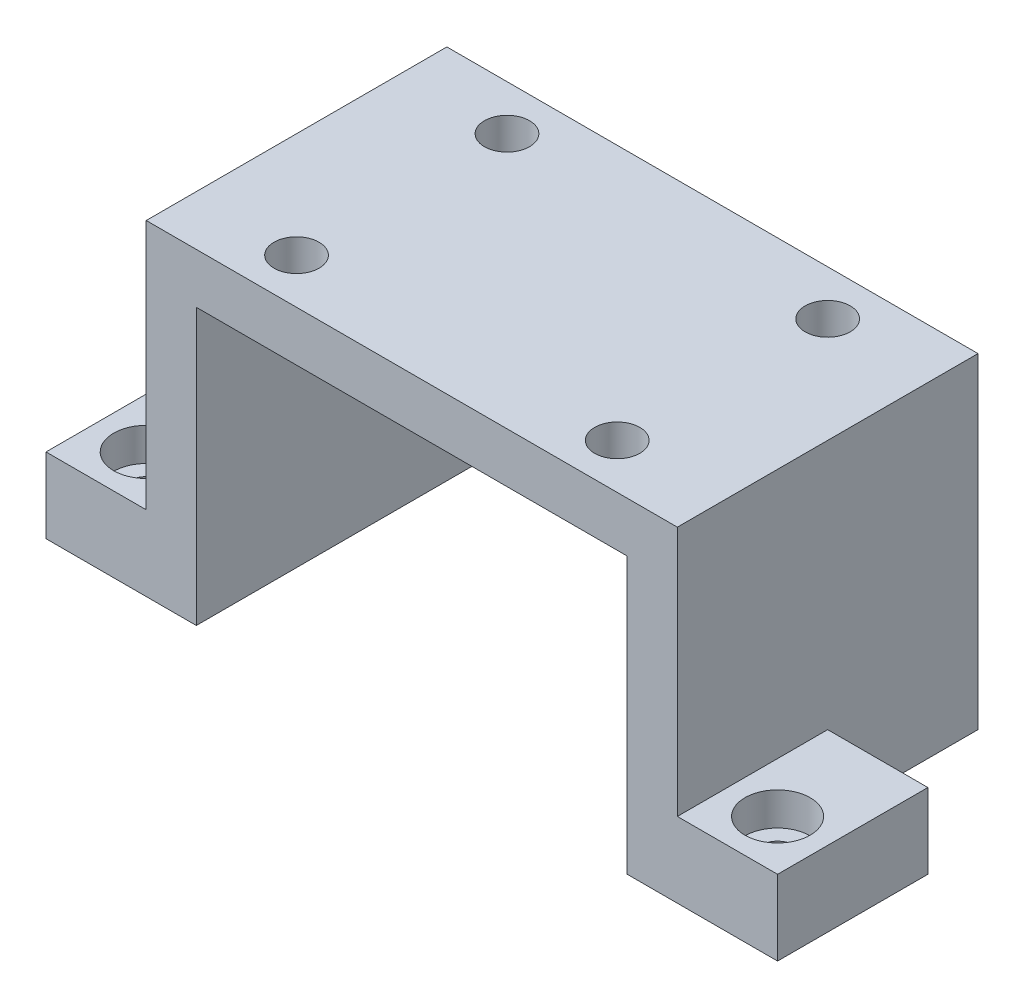
ISO-10303-21;
HEADER;
FILE_DESCRIPTION(('STEP AP214'),'2;1');
FILE_NAME('part.step','',(''),(''),'','','');
FILE_SCHEMA(('AUTOMOTIVE_DESIGN { 1 0 10303 214 1 1 1 1 }'));
ENDSEC;
DATA;
#1=APPLICATION_CONTEXT('core data for automotive mechanical design processes');
#2=APPLICATION_PROTOCOL_DEFINITION('international standard','automotive_design',2000,#1);
#3=PRODUCT_CONTEXT('',#1,'mechanical');
#4=PRODUCT('Part','Part','',(#3));
#5=PRODUCT_RELATED_PRODUCT_CATEGORY('part','',(#4));
#6=PRODUCT_DEFINITION_FORMATION('','',#4);
#7=PRODUCT_DEFINITION_CONTEXT('part definition',#1,'design');
#8=PRODUCT_DEFINITION('design','',#6,#7);
#9=PRODUCT_DEFINITION_SHAPE('','',#8);
#10=(LENGTH_UNIT() NAMED_UNIT(*) SI_UNIT(.MILLI.,.METRE.));
#11=(NAMED_UNIT(*) PLANE_ANGLE_UNIT() SI_UNIT($,.RADIAN.));
#12=(NAMED_UNIT(*) SI_UNIT($,.STERADIAN.) SOLID_ANGLE_UNIT());
#13=UNCERTAINTY_MEASURE_WITH_UNIT(LENGTH_MEASURE(1.E-05),#10,'distance_accuracy_value','');
#14=(GEOMETRIC_REPRESENTATION_CONTEXT(3) GLOBAL_UNCERTAINTY_ASSIGNED_CONTEXT((#13)) GLOBAL_UNIT_ASSIGNED_CONTEXT((#10,
#11,#12)) REPRESENTATION_CONTEXT('',''));
#15=CARTESIAN_POINT('',(0.,0.,0.));
#16=DIRECTION('',(0.,0.,1.));
#17=DIRECTION('',(1.,0.,0.));
#18=AXIS2_PLACEMENT_3D('',#15,#16,#17);
#19=CARTESIAN_POINT('',(-53.,10.,30.));
#20=DIRECTION('',(1.,0.,0.));
#21=DIRECTION('',(0.,0.,-1.));
#22=AXIS2_PLACEMENT_3D('',#19,#20,#21);
#23=PLANE('',#22);
#24=DIRECTION('',(0.,0.,-1.));
#25=VECTOR('',#24,1.);
#26=CARTESIAN_POINT('',(-53.,-40.,-30.));
#27=LINE('',#26,#25);
#28=CARTESIAN_POINT('',(-53.,-40.,30.));
#29=VERTEX_POINT('',#28);
#30=CARTESIAN_POINT('',(-53.,-40.,-30.));
#31=VERTEX_POINT('',#30);
#32=EDGE_CURVE('E49',#29,#31,#27,.T.);
#33=ORIENTED_EDGE('',*,*,#32,.F.);
#34=DIRECTION('',(0.,-1.,0.));
#35=VECTOR('',#34,1.);
#36=CARTESIAN_POINT('',(-53.,10.,30.));
#37=LINE('',#36,#35);
#38=CARTESIAN_POINT('',(-53.,10.,30.));
#39=VERTEX_POINT('',#38);
#40=EDGE_CURVE('E231',#39,#29,#37,.T.);
#41=ORIENTED_EDGE('',*,*,#40,.F.);
#42=DIRECTION('',(0.,0.,1.));
#43=VECTOR('',#42,1.);
#44=CARTESIAN_POINT('',(-53.,10.,30.));
#45=LINE('',#44,#43);
#46=CARTESIAN_POINT('',(-53.,10.,-30.));
#47=VERTEX_POINT('',#46);
#48=EDGE_CURVE('E222',#47,#39,#45,.T.);
#49=ORIENTED_EDGE('',*,*,#48,.F.);
#50=DIRECTION('',(0.,-1.,0.));
#51=VECTOR('',#50,1.);
#52=CARTESIAN_POINT('',(-53.,10.,-30.));
#53=LINE('',#52,#51);
#54=EDGE_CURVE('E42',#47,#31,#53,.T.);
#55=ORIENTED_EDGE('',*,*,#54,.T.);
#56=EDGE_LOOP('',(#33,#41,#49,#55));
#57=FACE_BOUND('',#56,.T.);
#58=ADVANCED_FACE('F34',(#57),#23,.F.);
#59=CARTESIAN_POINT('',(53.,10.,30.));
#60=DIRECTION('',(-1.,0.,0.));
#61=DIRECTION('',(0.,0.,1.));
#62=AXIS2_PLACEMENT_3D('',#59,#60,#61);
#63=PLANE('',#62);
#64=DIRECTION('',(0.,0.,1.));
#65=VECTOR('',#64,1.);
#66=CARTESIAN_POINT('',(53.,-40.,30.));
#67=LINE('',#66,#65);
#68=CARTESIAN_POINT('',(53.,-40.,0.));
#69=VERTEX_POINT('',#68);
#70=CARTESIAN_POINT('',(53.,-40.,30.));
#71=VERTEX_POINT('',#70);
#72=EDGE_CURVE('E173',#69,#71,#67,.T.);
#73=ORIENTED_EDGE('',*,*,#72,.F.);
#74=DIRECTION('',(0.,1.,0.));
#75=VECTOR('',#74,1.);
#76=CARTESIAN_POINT('',(53.,-40.,0.));
#77=LINE('',#76,#75);
#78=CARTESIAN_POINT('',(53.,-55.,0.));
#79=VERTEX_POINT('',#78);
#80=EDGE_CURVE('E57',#79,#69,#77,.T.);
#81=ORIENTED_EDGE('',*,*,#80,.F.);
#82=DIRECTION('',(0.,0.,1.));
#83=VECTOR('',#82,1.);
#84=CARTESIAN_POINT('',(53.,-55.,30.));
#85=LINE('',#84,#83);
#86=CARTESIAN_POINT('',(53.,-55.,-30.));
#87=VERTEX_POINT('',#86);
#88=EDGE_CURVE('E192',#87,#79,#85,.T.);
#89=ORIENTED_EDGE('',*,*,#88,.F.);
#90=DIRECTION('',(0.,-1.,0.));
#91=VECTOR('',#90,1.);
#92=CARTESIAN_POINT('',(53.,10.,-30.));
#93=LINE('',#92,#91);
#94=CARTESIAN_POINT('',(53.,10.,-30.));
#95=VERTEX_POINT('',#94);
#96=EDGE_CURVE('E11',#95,#87,#93,.T.);
#97=ORIENTED_EDGE('',*,*,#96,.F.);
#98=DIRECTION('',(0.,0.,-1.));
#99=VECTOR('',#98,1.);
#100=CARTESIAN_POINT('',(53.,10.,30.));
#101=LINE('',#100,#99);
#102=CARTESIAN_POINT('',(53.,10.,30.));
#103=VERTEX_POINT('',#102);
#104=EDGE_CURVE('E216',#103,#95,#101,.T.);
#105=ORIENTED_EDGE('',*,*,#104,.F.);
#106=DIRECTION('',(0.,-1.,0.));
#107=VECTOR('',#106,1.);
#108=CARTESIAN_POINT('',(53.,10.,30.));
#109=LINE('',#108,#107);
#110=EDGE_CURVE('E226',#103,#71,#109,.T.);
#111=ORIENTED_EDGE('',*,*,#110,.T.);
#112=EDGE_LOOP('',(#73,#81,#89,#97,#105,#111));
#113=FACE_BOUND('',#112,.T.);
#114=ADVANCED_FACE('F36',(#113),#63,.F.);
#115=CARTESIAN_POINT('',(0.,0.,0.));
#116=DIRECTION('',(0.,-1.,0.));
#117=DIRECTION('',(0.,0.,-1.));
#118=AXIS2_PLACEMENT_3D('',#115,#116,#117);
#119=PLANE('',#118);
#120=CARTESIAN_POINT('',(-32.,0.,21.));
#121=DIRECTION('',(0.,-1.,0.));
#122=DIRECTION('',(0.,0.,-1.));
#123=AXIS2_PLACEMENT_3D('',#120,#121,#122);
#124=CIRCLE('',#123,4.5);
#125=CARTESIAN_POINT('',(-32.,0.,16.5));
#126=VERTEX_POINT('',#125);
#127=EDGE_CURVE('E157',#126,#126,#124,.T.);
#128=ORIENTED_EDGE('',*,*,#127,.F.);
#129=EDGE_LOOP('',(#128));
#130=FACE_BOUND('',#129,.T.);
#131=CARTESIAN_POINT('',(32.,0.,21.));
#132=DIRECTION('',(0.,-1.,0.));
#133=DIRECTION('',(0.,0.,-1.));
#134=AXIS2_PLACEMENT_3D('',#131,#132,#133);
#135=CIRCLE('',#134,4.5);
#136=CARTESIAN_POINT('',(32.,0.,16.5));
#137=VERTEX_POINT('',#136);
#138=EDGE_CURVE('E418',#137,#137,#135,.T.);
#139=ORIENTED_EDGE('',*,*,#138,.F.);
#140=EDGE_LOOP('',(#139));
#141=FACE_BOUND('',#140,.T.);
#142=CARTESIAN_POINT('',(32.,0.,-21.));
#143=DIRECTION('',(0.,-1.,0.));
#144=DIRECTION('',(0.,0.,-1.));
#145=AXIS2_PLACEMENT_3D('',#142,#143,#144);
#146=CIRCLE('',#145,4.5);
#147=CARTESIAN_POINT('',(32.,0.,-25.5));
#148=VERTEX_POINT('',#147);
#149=EDGE_CURVE('E416',#148,#148,#146,.T.);
#150=ORIENTED_EDGE('',*,*,#149,.F.);
#151=EDGE_LOOP('',(#150));
#152=FACE_BOUND('',#151,.T.);
#153=CARTESIAN_POINT('',(-32.,0.,-21.));
#154=DIRECTION('',(0.,-1.,0.));
#155=DIRECTION('',(0.,0.,-1.));
#156=AXIS2_PLACEMENT_3D('',#153,#154,#155);
#157=CIRCLE('',#156,4.5);
#158=CARTESIAN_POINT('',(-32.,0.,-25.5));
#159=VERTEX_POINT('',#158);
#160=EDGE_CURVE('E413',#159,#159,#157,.T.);
#161=ORIENTED_EDGE('',*,*,#160,.F.);
#162=EDGE_LOOP('',(#161));
#163=FACE_BOUND('',#162,.T.);
#164=DIRECTION('',(-1.,0.,0.));
#165=VECTOR('',#164,1.);
#166=CARTESIAN_POINT('',(-53.,0.,-30.));
#167=LINE('',#166,#165);
#168=CARTESIAN_POINT('',(43.,0.,-30.));
#169=VERTEX_POINT('',#168);
#170=CARTESIAN_POINT('',(-43.,0.,-30.));
#171=VERTEX_POINT('',#170);
#172=EDGE_CURVE('E215',#169,#171,#167,.T.);
#173=ORIENTED_EDGE('',*,*,#172,.F.);
#174=DIRECTION('',(0.,0.,-1.));
#175=VECTOR('',#174,1.);
#176=CARTESIAN_POINT('',(43.,0.,30.));
#177=LINE('',#176,#175);
#178=CARTESIAN_POINT('',(43.,0.,30.));
#179=VERTEX_POINT('',#178);
#180=EDGE_CURVE('E191',#179,#169,#177,.T.);
#181=ORIENTED_EDGE('',*,*,#180,.F.);
#182=DIRECTION('',(1.,0.,0.));
#183=VECTOR('',#182,1.);
#184=CARTESIAN_POINT('',(-53.,0.,30.));
#185=LINE('',#184,#183);
#186=CARTESIAN_POINT('',(-43.,0.,30.));
#187=VERTEX_POINT('',#186);
#188=EDGE_CURVE('E220',#187,#179,#185,.T.);
#189=ORIENTED_EDGE('',*,*,#188,.F.);
#190=DIRECTION('',(0.,0.,1.));
#191=VECTOR('',#190,1.);
#192=CARTESIAN_POINT('',(-43.,0.,30.));
#193=LINE('',#192,#191);
#194=EDGE_CURVE('E141',#171,#187,#193,.T.);
#195=ORIENTED_EDGE('',*,*,#194,.F.);
#196=EDGE_LOOP('',(#173,#181,#189,#195));
#197=FACE_BOUND('',#196,.T.);
#198=ADVANCED_FACE('F252',(#130,#141,#152,#163,#197),#119,.T.);
#199=CARTESIAN_POINT('',(-53.,10.,-30.));
#200=DIRECTION('',(0.,0.,1.));
#201=DIRECTION('',(1.,0.,0.));
#202=AXIS2_PLACEMENT_3D('',#199,#200,#201);
#203=PLANE('',#202);
#204=ORIENTED_EDGE('',*,*,#96,.T.);
#205=DIRECTION('',(1.,0.,0.));
#206=VECTOR('',#205,1.);
#207=CARTESIAN_POINT('',(53.,-55.,-30.));
#208=LINE('',#207,#206);
#209=CARTESIAN_POINT('',(43.,-55.,-30.));
#210=VERTEX_POINT('',#209);
#211=EDGE_CURVE('E198',#210,#87,#208,.T.);
#212=ORIENTED_EDGE('',*,*,#211,.F.);
#213=DIRECTION('',(0.,1.,0.));
#214=VECTOR('',#213,1.);
#215=CARTESIAN_POINT('',(43.,-55.,-30.));
#216=LINE('',#215,#214);
#217=EDGE_CURVE('E201',#210,#169,#216,.T.);
#218=ORIENTED_EDGE('',*,*,#217,.T.);
#219=ORIENTED_EDGE('',*,*,#172,.T.);
#220=DIRECTION('',(0.,1.,0.));
#221=VECTOR('',#220,1.);
#222=CARTESIAN_POINT('',(-43.,-55.,-30.));
#223=LINE('',#222,#221);
#224=CARTESIAN_POINT('',(-43.,-55.,-30.));
#225=VERTEX_POINT('',#224);
#226=EDGE_CURVE('E137',#225,#171,#223,.T.);
#227=ORIENTED_EDGE('',*,*,#226,.F.);
#228=DIRECTION('',(1.,0.,0.));
#229=VECTOR('',#228,1.);
#230=CARTESIAN_POINT('',(-53.,-55.,-30.));
#231=LINE('',#230,#229);
#232=CARTESIAN_POINT('',(-73.,-55.,-30.));
#233=VERTEX_POINT('',#232);
#234=EDGE_CURVE('E130',#233,#225,#231,.T.);
#235=ORIENTED_EDGE('',*,*,#234,.F.);
#236=DIRECTION('',(0.,-1.,0.));
#237=VECTOR('',#236,1.);
#238=CARTESIAN_POINT('',(-73.,-55.,-30.));
#239=LINE('',#238,#237);
#240=CARTESIAN_POINT('',(-73.,-40.,-30.));
#241=VERTEX_POINT('',#240);
#242=EDGE_CURVE('E135',#241,#233,#239,.T.);
#243=ORIENTED_EDGE('',*,*,#242,.F.);
#244=DIRECTION('',(1.,0.,0.));
#245=VECTOR('',#244,1.);
#246=CARTESIAN_POINT('',(-73.,-40.,-30.));
#247=LINE('',#246,#245);
#248=EDGE_CURVE('E163',#241,#31,#247,.T.);
#249=ORIENTED_EDGE('',*,*,#248,.T.);
#250=ORIENTED_EDGE('',*,*,#54,.F.);
#251=DIRECTION('',(-1.,0.,0.));
#252=VECTOR('',#251,1.);
#253=CARTESIAN_POINT('',(-53.,10.,-30.));
#254=LINE('',#253,#252);
#255=EDGE_CURVE('E219',#95,#47,#254,.T.);
#256=ORIENTED_EDGE('',*,*,#255,.F.);
#257=EDGE_LOOP('',(#204,#212,#218,#219,#227,#235,#243,#249,#250,#256));
#258=FACE_BOUND('',#257,.T.);
#259=ADVANCED_FACE('F132',(#258),#203,.F.);
#260=CARTESIAN_POINT('',(-53.,10.,30.));
#261=DIRECTION('',(0.,0.,-1.));
#262=DIRECTION('',(-1.,0.,0.));
#263=AXIS2_PLACEMENT_3D('',#260,#261,#262);
#264=PLANE('',#263);
#265=ORIENTED_EDGE('',*,*,#40,.T.);
#266=DIRECTION('',(1.,0.,0.));
#267=VECTOR('',#266,1.);
#268=CARTESIAN_POINT('',(-73.,-40.,30.));
#269=LINE('',#268,#267);
#270=CARTESIAN_POINT('',(-73.,-40.,30.));
#271=VERTEX_POINT('',#270);
#272=EDGE_CURVE('E166',#271,#29,#269,.T.);
#273=ORIENTED_EDGE('',*,*,#272,.F.);
#274=DIRECTION('',(0.,1.,0.));
#275=VECTOR('',#274,1.);
#276=CARTESIAN_POINT('',(-73.,-55.,30.));
#277=LINE('',#276,#275);
#278=CARTESIAN_POINT('',(-73.,-55.,30.));
#279=VERTEX_POINT('',#278);
#280=EDGE_CURVE('E150',#279,#271,#277,.T.);
#281=ORIENTED_EDGE('',*,*,#280,.F.);
#282=DIRECTION('',(-1.,0.,0.));
#283=VECTOR('',#282,1.);
#284=CARTESIAN_POINT('',(-53.,-55.,30.));
#285=LINE('',#284,#283);
#286=CARTESIAN_POINT('',(-43.,-55.,30.));
#287=VERTEX_POINT('',#286);
#288=EDGE_CURVE('E147',#287,#279,#285,.T.);
#289=ORIENTED_EDGE('',*,*,#288,.F.);
#290=DIRECTION('',(0.,1.,0.));
#291=VECTOR('',#290,1.);
#292=CARTESIAN_POINT('',(-43.,-55.,30.));
#293=LINE('',#292,#291);
#294=EDGE_CURVE('E209',#287,#187,#293,.T.);
#295=ORIENTED_EDGE('',*,*,#294,.T.);
#296=ORIENTED_EDGE('',*,*,#188,.T.);
#297=DIRECTION('',(0.,1.,0.));
#298=VECTOR('',#297,1.);
#299=CARTESIAN_POINT('',(43.,-55.,30.));
#300=LINE('',#299,#298);
#301=CARTESIAN_POINT('',(43.,-55.,30.));
#302=VERTEX_POINT('',#301);
#303=EDGE_CURVE('E205',#302,#179,#300,.T.);
#304=ORIENTED_EDGE('',*,*,#303,.F.);
#305=DIRECTION('',(-1.,0.,0.));
#306=VECTOR('',#305,1.);
#307=CARTESIAN_POINT('',(53.,-55.,30.));
#308=LINE('',#307,#306);
#309=CARTESIAN_POINT('',(73.,-55.,30.));
#310=VERTEX_POINT('',#309);
#311=EDGE_CURVE('E194',#310,#302,#308,.T.);
#312=ORIENTED_EDGE('',*,*,#311,.F.);
#313=DIRECTION('',(0.,-1.,0.));
#314=VECTOR('',#313,1.);
#315=CARTESIAN_POINT('',(73.,-55.,30.));
#316=LINE('',#315,#314);
#317=CARTESIAN_POINT('',(73.,-40.,30.));
#318=VERTEX_POINT('',#317);
#319=EDGE_CURVE('E169',#318,#310,#316,.T.);
#320=ORIENTED_EDGE('',*,*,#319,.F.);
#321=DIRECTION('',(-1.,0.,0.));
#322=VECTOR('',#321,1.);
#323=CARTESIAN_POINT('',(73.,-40.,30.));
#324=LINE('',#323,#322);
#325=EDGE_CURVE('E179',#318,#71,#324,.T.);
#326=ORIENTED_EDGE('',*,*,#325,.T.);
#327=ORIENTED_EDGE('',*,*,#110,.F.);
#328=DIRECTION('',(1.,0.,0.));
#329=VECTOR('',#328,1.);
#330=CARTESIAN_POINT('',(-53.,10.,30.));
#331=LINE('',#330,#329);
#332=EDGE_CURVE('E224',#39,#103,#331,.T.);
#333=ORIENTED_EDGE('',*,*,#332,.F.);
#334=EDGE_LOOP('',(#265,#273,#281,#289,#295,#296,#304,#312,#320,#326,#327,#333));
#335=FACE_BOUND('',#334,.T.);
#336=ADVANCED_FACE('F238',(#335),#264,.F.);
#337=CARTESIAN_POINT('',(0.,10.,0.));
#338=DIRECTION('',(0.,-1.,0.));
#339=DIRECTION('',(0.,0.,-1.));
#340=AXIS2_PLACEMENT_3D('',#337,#338,#339);
#341=PLANE('',#340);
#342=CARTESIAN_POINT('',(-32.,10.,21.));
#343=DIRECTION('',(0.,1.,0.));
#344=DIRECTION('',(0.,0.,-1.));
#345=AXIS2_PLACEMENT_3D('',#342,#343,#344);
#346=CIRCLE('',#345,4.5);
#347=CARTESIAN_POINT('',(-32.,10.,16.5));
#348=VERTEX_POINT('',#347);
#349=EDGE_CURVE('E387',#348,#348,#346,.T.);
#350=ORIENTED_EDGE('',*,*,#349,.F.);
#351=EDGE_LOOP('',(#350));
#352=FACE_BOUND('',#351,.T.);
#353=CARTESIAN_POINT('',(32.,10.,21.));
#354=DIRECTION('',(0.,1.,0.));
#355=DIRECTION('',(0.,0.,1.));
#356=AXIS2_PLACEMENT_3D('',#353,#354,#355);
#357=CIRCLE('',#356,4.5);
#358=CARTESIAN_POINT('',(32.,10.,25.5));
#359=VERTEX_POINT('',#358);
#360=EDGE_CURVE('E406',#359,#359,#357,.T.);
#361=ORIENTED_EDGE('',*,*,#360,.F.);
#362=EDGE_LOOP('',(#361));
#363=FACE_BOUND('',#362,.T.);
#364=CARTESIAN_POINT('',(32.,10.,-21.));
#365=DIRECTION('',(0.,1.,0.));
#366=DIRECTION('',(0.,0.,-1.));
#367=AXIS2_PLACEMENT_3D('',#364,#365,#366);
#368=CIRCLE('',#367,4.5);
#369=CARTESIAN_POINT('',(32.,10.,-25.5));
#370=VERTEX_POINT('',#369);
#371=EDGE_CURVE('E402',#370,#370,#368,.T.);
#372=ORIENTED_EDGE('',*,*,#371,.F.);
#373=EDGE_LOOP('',(#372));
#374=FACE_BOUND('',#373,.T.);
#375=CARTESIAN_POINT('',(-32.,10.,-21.));
#376=DIRECTION('',(0.,1.,0.));
#377=DIRECTION('',(0.,0.,1.));
#378=AXIS2_PLACEMENT_3D('',#375,#376,#377);
#379=CIRCLE('',#378,4.5);
#380=CARTESIAN_POINT('',(-32.,10.,-16.5));
#381=VERTEX_POINT('',#380);
#382=EDGE_CURVE('E405',#381,#381,#379,.T.);
#383=ORIENTED_EDGE('',*,*,#382,.F.);
#384=EDGE_LOOP('',(#383));
#385=FACE_BOUND('',#384,.T.);
#386=ORIENTED_EDGE('',*,*,#104,.T.);
#387=ORIENTED_EDGE('',*,*,#255,.T.);
#388=ORIENTED_EDGE('',*,*,#48,.T.);
#389=ORIENTED_EDGE('',*,*,#332,.T.);
#390=EDGE_LOOP('',(#386,#387,#388,#389));
#391=FACE_BOUND('',#390,.T.);
#392=ADVANCED_FACE('F243',(#352,#363,#374,#385,#391),#341,.F.);
#393=CARTESIAN_POINT('',(-43.,-55.,30.));
#394=DIRECTION('',(-1.,0.,0.));
#395=DIRECTION('',(0.,0.,1.));
#396=AXIS2_PLACEMENT_3D('',#393,#394,#395);
#397=PLANE('',#396);
#398=ORIENTED_EDGE('',*,*,#194,.T.);
#399=ORIENTED_EDGE('',*,*,#294,.F.);
#400=DIRECTION('',(0.,0.,1.));
#401=VECTOR('',#400,1.);
#402=CARTESIAN_POINT('',(-43.,-55.,30.));
#403=LINE('',#402,#401);
#404=EDGE_CURVE('E140',#225,#287,#403,.T.);
#405=ORIENTED_EDGE('',*,*,#404,.F.);
#406=ORIENTED_EDGE('',*,*,#226,.T.);
#407=EDGE_LOOP('',(#398,#399,#405,#406));
#408=FACE_BOUND('',#407,.T.);
#409=ADVANCED_FACE('F270',(#408),#397,.F.);
#410=CARTESIAN_POINT('',(0.,-55.,0.));
#411=DIRECTION('',(0.,-1.,0.));
#412=DIRECTION('',(0.,0.,-1.));
#413=AXIS2_PLACEMENT_3D('',#410,#411,#412);
#414=PLANE('',#413);
#415=CARTESIAN_POINT('',(-63.,-55.,-20.));
#416=DIRECTION('',(0.,1.,0.));
#417=DIRECTION('',(0.,0.,1.));
#418=AXIS2_PLACEMENT_3D('',#415,#416,#417);
#419=CIRCLE('',#418,3.3);
#420=CARTESIAN_POINT('',(-63.,-55.,-16.7));
#421=VERTEX_POINT('',#420);
#422=EDGE_CURVE('E364',#421,#421,#419,.T.);
#423=ORIENTED_EDGE('',*,*,#422,.T.);
#424=EDGE_LOOP('',(#423));
#425=FACE_BOUND('',#424,.T.);
#426=CARTESIAN_POINT('',(-63.,-55.,20.));
#427=DIRECTION('',(0.,1.,0.));
#428=DIRECTION('',(0.,0.,1.));
#429=AXIS2_PLACEMENT_3D('',#426,#427,#428);
#430=CIRCLE('',#429,3.3);
#431=CARTESIAN_POINT('',(-63.,-55.,23.3));
#432=VERTEX_POINT('',#431);
#433=EDGE_CURVE('E368',#432,#432,#430,.T.);
#434=ORIENTED_EDGE('',*,*,#433,.T.);
#435=EDGE_LOOP('',(#434));
#436=FACE_BOUND('',#435,.T.);
#437=ORIENTED_EDGE('',*,*,#288,.T.);
#438=DIRECTION('',(0.,0.,1.));
#439=VECTOR('',#438,1.);
#440=CARTESIAN_POINT('',(-73.,-55.,-30.));
#441=LINE('',#440,#439);
#442=EDGE_CURVE('E144',#233,#279,#441,.T.);
#443=ORIENTED_EDGE('',*,*,#442,.F.);
#444=ORIENTED_EDGE('',*,*,#234,.T.);
#445=ORIENTED_EDGE('',*,*,#404,.T.);
#446=EDGE_LOOP('',(#437,#443,#444,#445));
#447=FACE_BOUND('',#446,.T.);
#448=ADVANCED_FACE('F145',(#425,#436,#447),#414,.T.);
#449=CARTESIAN_POINT('',(43.,-55.,30.));
#450=DIRECTION('',(1.,0.,0.));
#451=DIRECTION('',(0.,0.,-1.));
#452=AXIS2_PLACEMENT_3D('',#449,#450,#451);
#453=PLANE('',#452);
#454=ORIENTED_EDGE('',*,*,#180,.T.);
#455=ORIENTED_EDGE('',*,*,#217,.F.);
#456=DIRECTION('',(0.,0.,-1.));
#457=VECTOR('',#456,1.);
#458=CARTESIAN_POINT('',(43.,-55.,30.));
#459=LINE('',#458,#457);
#460=EDGE_CURVE('E196',#302,#210,#459,.T.);
#461=ORIENTED_EDGE('',*,*,#460,.F.);
#462=ORIENTED_EDGE('',*,*,#303,.T.);
#463=EDGE_LOOP('',(#454,#455,#461,#462));
#464=FACE_BOUND('',#463,.T.);
#465=ADVANCED_FACE('F283',(#464),#453,.F.);
#466=CARTESIAN_POINT('',(0.,-55.,0.));
#467=DIRECTION('',(0.,1.,0.));
#468=DIRECTION('',(0.,0.,1.));
#469=AXIS2_PLACEMENT_3D('',#466,#467,#468);
#470=PLANE('',#469);
#471=CARTESIAN_POINT('',(63.,-55.,20.));
#472=DIRECTION('',(0.,1.,0.));
#473=DIRECTION('',(0.,0.,1.));
#474=AXIS2_PLACEMENT_3D('',#471,#472,#473);
#475=CIRCLE('',#474,3.29999999999999);
#476=CARTESIAN_POINT('',(63.,-55.,23.3));
#477=VERTEX_POINT('',#476);
#478=EDGE_CURVE('E378',#477,#477,#475,.T.);
#479=ORIENTED_EDGE('',*,*,#478,.T.);
#480=EDGE_LOOP('',(#479));
#481=FACE_BOUND('',#480,.T.);
#482=ORIENTED_EDGE('',*,*,#88,.T.);
#483=DIRECTION('',(-1.,0.,0.));
#484=VECTOR('',#483,1.);
#485=CARTESIAN_POINT('',(73.,-55.,0.));
#486=LINE('',#485,#484);
#487=CARTESIAN_POINT('',(73.,-55.,0.));
#488=VERTEX_POINT('',#487);
#489=EDGE_CURVE('E188',#488,#79,#486,.T.);
#490=ORIENTED_EDGE('',*,*,#489,.F.);
#491=DIRECTION('',(0.,0.,-1.));
#492=VECTOR('',#491,1.);
#493=CARTESIAN_POINT('',(73.,-55.,30.));
#494=LINE('',#493,#492);
#495=EDGE_CURVE('E172',#310,#488,#494,.T.);
#496=ORIENTED_EDGE('',*,*,#495,.F.);
#497=ORIENTED_EDGE('',*,*,#311,.T.);
#498=ORIENTED_EDGE('',*,*,#460,.T.);
#499=ORIENTED_EDGE('',*,*,#211,.T.);
#500=EDGE_LOOP('',(#482,#490,#496,#497,#498,#499));
#501=FACE_BOUND('',#500,.T.);
#502=ADVANCED_FACE('F247',(#481,#501),#470,.F.);
#503=CARTESIAN_POINT('',(73.,-40.,0.));
#504=DIRECTION('',(0.,0.,1.));
#505=DIRECTION('',(1.,0.,0.));
#506=AXIS2_PLACEMENT_3D('',#503,#504,#505);
#507=PLANE('',#506);
#508=ORIENTED_EDGE('',*,*,#80,.T.);
#509=DIRECTION('',(-1.,0.,0.));
#510=VECTOR('',#509,1.);
#511=CARTESIAN_POINT('',(73.,-40.,0.));
#512=LINE('',#511,#510);
#513=CARTESIAN_POINT('',(73.,-40.,0.));
#514=VERTEX_POINT('',#513);
#515=EDGE_CURVE('E185',#514,#69,#512,.T.);
#516=ORIENTED_EDGE('',*,*,#515,.F.);
#517=DIRECTION('',(0.,1.,0.));
#518=VECTOR('',#517,1.);
#519=CARTESIAN_POINT('',(73.,-40.,0.));
#520=LINE('',#519,#518);
#521=EDGE_CURVE('E175',#488,#514,#520,.T.);
#522=ORIENTED_EDGE('',*,*,#521,.F.);
#523=ORIENTED_EDGE('',*,*,#489,.T.);
#524=EDGE_LOOP('',(#508,#516,#522,#523));
#525=FACE_BOUND('',#524,.T.);
#526=ADVANCED_FACE('F290',(#525),#507,.F.);
#527=CARTESIAN_POINT('',(73.,-40.,30.));
#528=DIRECTION('',(0.,-1.,0.));
#529=DIRECTION('',(0.,0.,-1.));
#530=AXIS2_PLACEMENT_3D('',#527,#528,#529);
#531=PLANE('',#530);
#532=CARTESIAN_POINT('',(63.,-40.,20.));
#533=DIRECTION('',(0.,1.,0.));
#534=DIRECTION('',(0.,0.,1.));
#535=AXIS2_PLACEMENT_3D('',#532,#533,#534);
#536=CIRCLE('',#535,6.5);
#537=CARTESIAN_POINT('',(63.,-40.,26.5));
#538=VERTEX_POINT('',#537);
#539=EDGE_CURVE('E388',#538,#538,#536,.T.);
#540=ORIENTED_EDGE('',*,*,#539,.F.);
#541=EDGE_LOOP('',(#540));
#542=FACE_BOUND('',#541,.T.);
#543=ORIENTED_EDGE('',*,*,#72,.T.);
#544=ORIENTED_EDGE('',*,*,#325,.F.);
#545=DIRECTION('',(0.,0.,1.));
#546=VECTOR('',#545,1.);
#547=CARTESIAN_POINT('',(73.,-40.,30.));
#548=LINE('',#547,#546);
#549=EDGE_CURVE('E177',#514,#318,#548,.T.);
#550=ORIENTED_EDGE('',*,*,#549,.F.);
#551=ORIENTED_EDGE('',*,*,#515,.T.);
#552=EDGE_LOOP('',(#543,#544,#550,#551));
#553=FACE_BOUND('',#552,.T.);
#554=ADVANCED_FACE('F294',(#542,#553),#531,.F.);
#555=CARTESIAN_POINT('',(73.,0.,0.));
#556=DIRECTION('',(-1.,0.,0.));
#557=DIRECTION('',(0.,0.,1.));
#558=AXIS2_PLACEMENT_3D('',#555,#556,#557);
#559=PLANE('',#558);
#560=ORIENTED_EDGE('',*,*,#319,.T.);
#561=ORIENTED_EDGE('',*,*,#495,.T.);
#562=ORIENTED_EDGE('',*,*,#521,.T.);
#563=ORIENTED_EDGE('',*,*,#549,.T.);
#564=EDGE_LOOP('',(#560,#561,#562,#563));
#565=FACE_BOUND('',#564,.T.);
#566=ADVANCED_FACE('F298',(#565),#559,.F.);
#567=CARTESIAN_POINT('',(-73.,-40.,-30.));
#568=DIRECTION('',(0.,-1.,0.));
#569=DIRECTION('',(0.,0.,-1.));
#570=AXIS2_PLACEMENT_3D('',#567,#568,#569);
#571=PLANE('',#570);
#572=CARTESIAN_POINT('',(-63.,-40.,-20.));
#573=DIRECTION('',(0.,1.,0.));
#574=DIRECTION('',(0.,0.,1.));
#575=AXIS2_PLACEMENT_3D('',#572,#573,#574);
#576=CIRCLE('',#575,6.5);
#577=CARTESIAN_POINT('',(-63.,-40.,-13.5));
#578=VERTEX_POINT('',#577);
#579=EDGE_CURVE('E394',#578,#578,#576,.T.);
#580=ORIENTED_EDGE('',*,*,#579,.F.);
#581=EDGE_LOOP('',(#580));
#582=FACE_BOUND('',#581,.T.);
#583=CARTESIAN_POINT('',(-63.,-40.,20.));
#584=DIRECTION('',(0.,1.,0.));
#585=DIRECTION('',(0.,0.,1.));
#586=AXIS2_PLACEMENT_3D('',#583,#584,#585);
#587=CIRCLE('',#586,6.5);
#588=CARTESIAN_POINT('',(-63.,-40.,26.5));
#589=VERTEX_POINT('',#588);
#590=EDGE_CURVE('E370',#589,#589,#587,.T.);
#591=ORIENTED_EDGE('',*,*,#590,.F.);
#592=EDGE_LOOP('',(#591));
#593=FACE_BOUND('',#592,.T.);
#594=ORIENTED_EDGE('',*,*,#32,.T.);
#595=ORIENTED_EDGE('',*,*,#248,.F.);
#596=DIRECTION('',(0.,0.,-1.));
#597=VECTOR('',#596,1.);
#598=CARTESIAN_POINT('',(-73.,-40.,-30.));
#599=LINE('',#598,#597);
#600=EDGE_CURVE('E154',#271,#241,#599,.T.);
#601=ORIENTED_EDGE('',*,*,#600,.F.);
#602=ORIENTED_EDGE('',*,*,#272,.T.);
#603=EDGE_LOOP('',(#594,#595,#601,#602));
#604=FACE_BOUND('',#603,.T.);
#605=ADVANCED_FACE('F235',(#582,#593,#604),#571,.F.);
#606=CARTESIAN_POINT('',(-73.,0.,0.));
#607=DIRECTION('',(1.,0.,0.));
#608=DIRECTION('',(0.,0.,-1.));
#609=AXIS2_PLACEMENT_3D('',#606,#607,#608);
#610=PLANE('',#609);
#611=ORIENTED_EDGE('',*,*,#242,.T.);
#612=ORIENTED_EDGE('',*,*,#442,.T.);
#613=ORIENTED_EDGE('',*,*,#280,.T.);
#614=ORIENTED_EDGE('',*,*,#600,.T.);
#615=EDGE_LOOP('',(#611,#612,#613,#614));
#616=FACE_BOUND('',#615,.T.);
#617=ADVANCED_FACE('F152',(#616),#610,.F.);
#618=CARTESIAN_POINT('',(-32.,-55.,-21.));
#619=DIRECTION('',(0.,1.,0.));
#620=DIRECTION('',(0.,0.,1.));
#621=AXIS2_PLACEMENT_3D('',#618,#619,#620);
#622=CYLINDRICAL_SURFACE('',#621,4.5);
#623=ORIENTED_EDGE('',*,*,#160,.T.);
#624=EDGE_LOOP('',(#623));
#625=FACE_BOUND('',#624,.T.);
#626=ORIENTED_EDGE('',*,*,#382,.T.);
#627=EDGE_LOOP('',(#626));
#628=FACE_BOUND('',#627,.T.);
#629=ADVANCED_FACE('F308',(#625,#628),#622,.F.);
#630=CARTESIAN_POINT('',(32.,-55.,-21.));
#631=DIRECTION('',(0.,1.,0.));
#632=DIRECTION('',(0.,0.,1.));
#633=AXIS2_PLACEMENT_3D('',#630,#631,#632);
#634=CYLINDRICAL_SURFACE('',#633,4.5);
#635=ORIENTED_EDGE('',*,*,#149,.T.);
#636=EDGE_LOOP('',(#635));
#637=FACE_BOUND('',#636,.T.);
#638=ORIENTED_EDGE('',*,*,#371,.T.);
#639=EDGE_LOOP('',(#638));
#640=FACE_BOUND('',#639,.T.);
#641=ADVANCED_FACE('F311',(#637,#640),#634,.F.);
#642=CARTESIAN_POINT('',(32.,-55.,21.));
#643=DIRECTION('',(0.,1.,0.));
#644=DIRECTION('',(0.,0.,1.));
#645=AXIS2_PLACEMENT_3D('',#642,#643,#644);
#646=CYLINDRICAL_SURFACE('',#645,4.5);
#647=ORIENTED_EDGE('',*,*,#138,.T.);
#648=EDGE_LOOP('',(#647));
#649=FACE_BOUND('',#648,.T.);
#650=ORIENTED_EDGE('',*,*,#360,.T.);
#651=EDGE_LOOP('',(#650));
#652=FACE_BOUND('',#651,.T.);
#653=ADVANCED_FACE('F317',(#649,#652),#646,.F.);
#654=CARTESIAN_POINT('',(-32.,-55.,21.));
#655=DIRECTION('',(0.,1.,0.));
#656=DIRECTION('',(0.,0.,1.));
#657=AXIS2_PLACEMENT_3D('',#654,#655,#656);
#658=CYLINDRICAL_SURFACE('',#657,4.5);
#659=ORIENTED_EDGE('',*,*,#127,.T.);
#660=EDGE_LOOP('',(#659));
#661=FACE_BOUND('',#660,.T.);
#662=ORIENTED_EDGE('',*,*,#349,.T.);
#663=EDGE_LOOP('',(#662));
#664=FACE_BOUND('',#663,.T.);
#665=ADVANCED_FACE('F313',(#661,#664),#658,.F.);
#666=CARTESIAN_POINT('',(-63.,-46.6,20.));
#667=DIRECTION('',(0.,1.,0.));
#668=DIRECTION('',(0.,0.,1.));
#669=AXIS2_PLACEMENT_3D('',#666,#667,#668);
#670=CYLINDRICAL_SURFACE('',#669,6.5);
#671=CARTESIAN_POINT('',(-63.,-46.6,20.));
#672=DIRECTION('',(0.,1.,0.));
#673=DIRECTION('',(0.,0.,1.));
#674=AXIS2_PLACEMENT_3D('',#671,#672,#673);
#675=CIRCLE('',#674,6.5);
#676=CARTESIAN_POINT('',(-63.,-46.6,26.5));
#677=VERTEX_POINT('',#676);
#678=EDGE_CURVE('E397',#677,#677,#675,.T.);
#679=ORIENTED_EDGE('',*,*,#678,.F.);
#680=EDGE_LOOP('',(#679));
#681=FACE_BOUND('',#680,.T.);
#682=ORIENTED_EDGE('',*,*,#590,.T.);
#683=EDGE_LOOP('',(#682));
#684=FACE_BOUND('',#683,.T.);
#685=ADVANCED_FACE('F316',(#681,#684),#670,.F.);
#686=CARTESIAN_POINT('',(-63.,-46.6,20.));
#687=DIRECTION('',(0.,1.,0.));
#688=DIRECTION('',(0.,0.,1.));
#689=AXIS2_PLACEMENT_3D('',#686,#687,#688);
#690=PLANE('',#689);
#691=CARTESIAN_POINT('',(-63.,-46.6,20.));
#692=DIRECTION('',(0.,1.,0.));
#693=DIRECTION('',(0.,0.,1.));
#694=AXIS2_PLACEMENT_3D('',#691,#692,#693);
#695=CIRCLE('',#694,3.3);
#696=CARTESIAN_POINT('',(-63.,-46.6,23.3));
#697=VERTEX_POINT('',#696);
#698=EDGE_CURVE('E373',#697,#697,#695,.T.);
#699=ORIENTED_EDGE('',*,*,#698,.F.);
#700=EDGE_LOOP('',(#699));
#701=FACE_BOUND('',#700,.T.);
#702=ORIENTED_EDGE('',*,*,#678,.T.);
#703=EDGE_LOOP('',(#702));
#704=FACE_BOUND('',#703,.T.);
#705=ADVANCED_FACE('F327',(#701,#704),#690,.T.);
#706=CARTESIAN_POINT('',(-63.,-46.6,-20.));
#707=DIRECTION('',(0.,1.,0.));
#708=DIRECTION('',(0.,0.,1.));
#709=AXIS2_PLACEMENT_3D('',#706,#707,#708);
#710=CYLINDRICAL_SURFACE('',#709,6.5);
#711=CARTESIAN_POINT('',(-63.,-46.6,-20.));
#712=DIRECTION('',(0.,1.,0.));
#713=DIRECTION('',(0.,0.,1.));
#714=AXIS2_PLACEMENT_3D('',#711,#712,#713);
#715=CIRCLE('',#714,6.5);
#716=CARTESIAN_POINT('',(-63.,-46.6,-13.5));
#717=VERTEX_POINT('',#716);
#718=EDGE_CURVE('E391',#717,#717,#715,.T.);
#719=ORIENTED_EDGE('',*,*,#718,.F.);
#720=EDGE_LOOP('',(#719));
#721=FACE_BOUND('',#720,.T.);
#722=ORIENTED_EDGE('',*,*,#579,.T.);
#723=EDGE_LOOP('',(#722));
#724=FACE_BOUND('',#723,.T.);
#725=ADVANCED_FACE('F331',(#721,#724),#710,.F.);
#726=CARTESIAN_POINT('',(-63.,-46.6,-20.));
#727=DIRECTION('',(0.,1.,0.));
#728=DIRECTION('',(0.,0.,1.));
#729=AXIS2_PLACEMENT_3D('',#726,#727,#728);
#730=PLANE('',#729);
#731=CARTESIAN_POINT('',(-63.,-46.6,-20.));
#732=DIRECTION('',(0.,1.,0.));
#733=DIRECTION('',(0.,0.,1.));
#734=AXIS2_PLACEMENT_3D('',#731,#732,#733);
#735=CIRCLE('',#734,3.3);
#736=CARTESIAN_POINT('',(-63.,-46.6,-16.7));
#737=VERTEX_POINT('',#736);
#738=EDGE_CURVE('E367',#737,#737,#735,.T.);
#739=ORIENTED_EDGE('',*,*,#738,.F.);
#740=EDGE_LOOP('',(#739));
#741=FACE_BOUND('',#740,.T.);
#742=ORIENTED_EDGE('',*,*,#718,.T.);
#743=EDGE_LOOP('',(#742));
#744=FACE_BOUND('',#743,.T.);
#745=ADVANCED_FACE('F335',(#741,#744),#730,.T.);
#746=CARTESIAN_POINT('',(63.,-46.6,20.));
#747=DIRECTION('',(0.,1.,0.));
#748=DIRECTION('',(0.,0.,1.));
#749=AXIS2_PLACEMENT_3D('',#746,#747,#748);
#750=CYLINDRICAL_SURFACE('',#749,6.5);
#751=CARTESIAN_POINT('',(63.,-46.6,20.));
#752=DIRECTION('',(0.,1.,0.));
#753=DIRECTION('',(0.,0.,1.));
#754=AXIS2_PLACEMENT_3D('',#751,#752,#753);
#755=CIRCLE('',#754,6.5);
#756=CARTESIAN_POINT('',(63.,-46.6,26.5));
#757=VERTEX_POINT('',#756);
#758=EDGE_CURVE('E384',#757,#757,#755,.T.);
#759=ORIENTED_EDGE('',*,*,#758,.F.);
#760=EDGE_LOOP('',(#759));
#761=FACE_BOUND('',#760,.T.);
#762=ORIENTED_EDGE('',*,*,#539,.T.);
#763=EDGE_LOOP('',(#762));
#764=FACE_BOUND('',#763,.T.);
#765=ADVANCED_FACE('F339',(#761,#764),#750,.F.);
#766=CARTESIAN_POINT('',(63.,-46.6,20.));
#767=DIRECTION('',(0.,1.,0.));
#768=DIRECTION('',(0.,0.,1.));
#769=AXIS2_PLACEMENT_3D('',#766,#767,#768);
#770=PLANE('',#769);
#771=CARTESIAN_POINT('',(63.,-46.6,20.));
#772=DIRECTION('',(0.,1.,0.));
#773=DIRECTION('',(0.,0.,1.));
#774=AXIS2_PLACEMENT_3D('',#771,#772,#773);
#775=CIRCLE('',#774,3.29999999999999);
#776=CARTESIAN_POINT('',(63.,-46.6,23.3));
#777=VERTEX_POINT('',#776);
#778=EDGE_CURVE('E381',#777,#777,#775,.T.);
#779=ORIENTED_EDGE('',*,*,#778,.F.);
#780=EDGE_LOOP('',(#779));
#781=FACE_BOUND('',#780,.T.);
#782=ORIENTED_EDGE('',*,*,#758,.T.);
#783=EDGE_LOOP('',(#782));
#784=FACE_BOUND('',#783,.T.);
#785=ADVANCED_FACE('F343',(#781,#784),#770,.T.);
#786=CARTESIAN_POINT('',(63.,-55.,20.));
#787=DIRECTION('',(0.,1.,0.));
#788=DIRECTION('',(0.,0.,1.));
#789=AXIS2_PLACEMENT_3D('',#786,#787,#788);
#790=CYLINDRICAL_SURFACE('',#789,3.29999999999999);
#791=ORIENTED_EDGE('',*,*,#478,.F.);
#792=EDGE_LOOP('',(#791));
#793=FACE_BOUND('',#792,.T.);
#794=ORIENTED_EDGE('',*,*,#778,.T.);
#795=EDGE_LOOP('',(#794));
#796=FACE_BOUND('',#795,.T.);
#797=ADVANCED_FACE('F347',(#793,#796),#790,.F.);
#798=CARTESIAN_POINT('',(-63.,-55.,20.));
#799=DIRECTION('',(0.,1.,0.));
#800=DIRECTION('',(0.,0.,1.));
#801=AXIS2_PLACEMENT_3D('',#798,#799,#800);
#802=CYLINDRICAL_SURFACE('',#801,3.3);
#803=ORIENTED_EDGE('',*,*,#433,.F.);
#804=EDGE_LOOP('',(#803));
#805=FACE_BOUND('',#804,.T.);
#806=ORIENTED_EDGE('',*,*,#698,.T.);
#807=EDGE_LOOP('',(#806));
#808=FACE_BOUND('',#807,.T.);
#809=ADVANCED_FACE('F351',(#805,#808),#802,.F.);
#810=CARTESIAN_POINT('',(-63.,-55.,-20.));
#811=DIRECTION('',(0.,1.,0.));
#812=DIRECTION('',(0.,0.,1.));
#813=AXIS2_PLACEMENT_3D('',#810,#811,#812);
#814=CYLINDRICAL_SURFACE('',#813,3.3);
#815=ORIENTED_EDGE('',*,*,#422,.F.);
#816=EDGE_LOOP('',(#815));
#817=FACE_BOUND('',#816,.T.);
#818=ORIENTED_EDGE('',*,*,#738,.T.);
#819=EDGE_LOOP('',(#818));
#820=FACE_BOUND('',#819,.T.);
#821=ADVANCED_FACE('F355',(#817,#820),#814,.F.);
#822=CLOSED_SHELL('',(#58,#114,#198,#259,#336,#392,#409,#448,#465,#502,#526,#554,#566,#605,#617,
#629,#641,#653,#665,#685,#705,#725,#745,#765,#785,#797,#809,#821));
#823=MANIFOLD_SOLID_BREP('B2',#822);
#824=ADVANCED_BREP_SHAPE_REPRESENTATION('',(#18,#823),#14);
#825=SHAPE_DEFINITION_REPRESENTATION(#9,#824);
ENDSEC;
END-ISO-10303-21;
